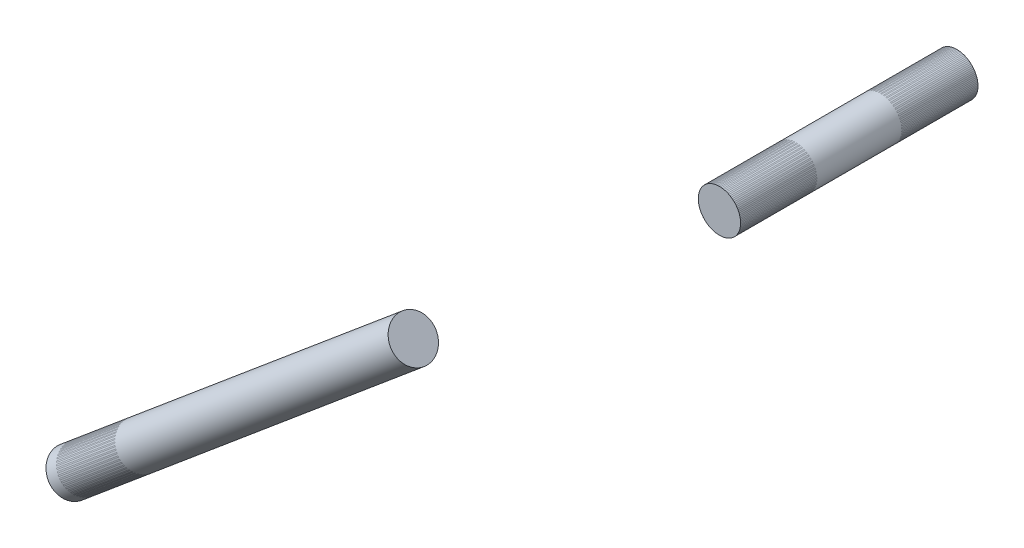
ISO-10303-21;
HEADER;
FILE_DESCRIPTION(('STEP AP214'),'2;1');
FILE_NAME('part.step','',(''),(''),'','','');
FILE_SCHEMA(('AUTOMOTIVE_DESIGN { 1 0 10303 214 1 1 1 1 }'));
ENDSEC;
DATA;
#1=APPLICATION_CONTEXT('core data for automotive mechanical design processes');
#2=APPLICATION_PROTOCOL_DEFINITION('international standard','automotive_design',2000,#1);
#3=PRODUCT_CONTEXT('',#1,'mechanical');
#4=PRODUCT('Part','Part','',(#3));
#5=PRODUCT_RELATED_PRODUCT_CATEGORY('part','',(#4));
#6=PRODUCT_DEFINITION_FORMATION('','',#4);
#7=PRODUCT_DEFINITION_CONTEXT('part definition',#1,'design');
#8=PRODUCT_DEFINITION('design','',#6,#7);
#9=PRODUCT_DEFINITION_SHAPE('','',#8);
#10=(LENGTH_UNIT() NAMED_UNIT(*) SI_UNIT(.MILLI.,.METRE.));
#11=(NAMED_UNIT(*) PLANE_ANGLE_UNIT() SI_UNIT($,.RADIAN.));
#12=(NAMED_UNIT(*) SI_UNIT($,.STERADIAN.) SOLID_ANGLE_UNIT());
#13=UNCERTAINTY_MEASURE_WITH_UNIT(LENGTH_MEASURE(1.E-05),#10,'distance_accuracy_value','');
#14=(GEOMETRIC_REPRESENTATION_CONTEXT(3) GLOBAL_UNCERTAINTY_ASSIGNED_CONTEXT((#13)) GLOBAL_UNIT_ASSIGNED_CONTEXT((#10,
#11,#12)) REPRESENTATION_CONTEXT('',''));
#15=CARTESIAN_POINT('',(0.,0.,0.));
#16=DIRECTION('',(0.,0.,1.));
#17=DIRECTION('',(1.,0.,0.));
#18=AXIS2_PLACEMENT_3D('',#15,#16,#17);
#19=CARTESIAN_POINT('',(0.,0.,48.2981000000004));
#20=DIRECTION('',(0.,0.,-1.));
#21=DIRECTION('',(-1.,0.,0.));
#22=AXIS2_PLACEMENT_3D('',#19,#20,#21);
#23=PLANE('',#22);
#24=CARTESIAN_POINT('',(0.,0.,48.2981000000004));
#25=DIRECTION('',(0.,0.,-1.));
#26=DIRECTION('',(-1.,0.,0.));
#27=AXIS2_PLACEMENT_3D('',#24,#25,#26);
#28=CIRCLE('',#27,6.35);
#29=CARTESIAN_POINT('',(-6.35000000000006,0.,48.2981000000004));
#30=VERTEX_POINT('',#29);
#31=EDGE_CURVE('E49',#30,#30,#28,.T.);
#32=ORIENTED_EDGE('',*,*,#31,.F.);
#33=EDGE_LOOP('',(#32));
#34=FACE_BOUND('',#33,.T.);
#35=ADVANCED_FACE('F42',(#34),#23,.F.);
#36=CARTESIAN_POINT('',(0.,0.,-40.8205122421383));
#37=DIRECTION('',(0.,0.,1.));
#38=DIRECTION('',(1.,0.,0.));
#39=AXIS2_PLACEMENT_3D('',#36,#37,#38);
#40=CYLINDRICAL_SURFACE('',#39,6.35);
#41=CARTESIAN_POINT('',(0.,0.,-22.86));
#42=DIRECTION('',(0.,0.,1.));
#43=DIRECTION('',(1.,0.,0.));
#44=AXIS2_PLACEMENT_3D('',#41,#42,#43);
#45=CIRCLE('',#44,6.35);
#46=CARTESIAN_POINT('',(6.34999999999994,0.,-22.86));
#47=VERTEX_POINT('',#46);
#48=EDGE_CURVE('E11',#47,#47,#45,.T.);
#49=ORIENTED_EDGE('',*,*,#48,.T.);
#50=EDGE_LOOP('',(#49));
#51=FACE_BOUND('',#50,.T.);
#52=ORIENTED_EDGE('',*,*,#31,.T.);
#53=EDGE_LOOP('',(#52));
#54=FACE_BOUND('',#53,.T.);
#55=ADVANCED_FACE('F44',(#51,#54),#40,.T.);
#56=CARTESIAN_POINT('',(0.,0.,-22.86));
#57=DIRECTION('',(0.,0.,1.));
#58=DIRECTION('',(1.,0.,0.));
#59=AXIS2_PLACEMENT_3D('',#56,#57,#58);
#60=PLANE('',#59);
#61=ORIENTED_EDGE('',*,*,#48,.F.);
#62=EDGE_LOOP('',(#61));
#63=FACE_BOUND('',#62,.T.);
#64=ADVANCED_FACE('F60',(#63),#60,.F.);
#65=CLOSED_SHELL('',(#35,#55,#64));
#66=MANIFOLD_SOLID_BREP('B2',#65);
#67=CARTESIAN_POINT('',(-181.126806004137,-151.832093299604,61.5061000000005));
#68=DIRECTION('',(0.76635965763956,0.64241176448021,0.));
#69=DIRECTION('',(-0.64241176448021,0.76635965763956,0.));
#70=AXIS2_PLACEMENT_3D('',#67,#68,#69);
#71=PLANE('',#70);
#72=CARTESIAN_POINT('',(-181.126806004137,-151.832093299604,61.5061000000005));
#73=DIRECTION('',(0.76635965763956,0.64241176448021,0.));
#74=DIRECTION('',(-0.64241176448021,0.76635965763956,0.));
#75=AXIS2_PLACEMENT_3D('',#72,#73,#74);
#76=CIRCLE('',#75,6.35000000000001);
#77=CARTESIAN_POINT('',(-185.206120708586,-146.965709473593,61.5061000000005));
#78=VERTEX_POINT('',#77);
#79=EDGE_CURVE('E98',#78,#78,#76,.T.);
#80=ORIENTED_EDGE('',*,*,#79,.F.);
#81=EDGE_LOOP('',(#80));
#82=FACE_BOUND('',#81,.T.);
#83=ADVANCED_FACE('F91',(#82),#71,.F.);
#84=CARTESIAN_POINT('',(-64.7983032426142,-54.3180893023858,61.5061000000005));
#85=DIRECTION('',(-0.76635965763956,-0.64241176448021,0.));
#86=DIRECTION('',(0.64241176448021,-0.76635965763956,0.));
#87=AXIS2_PLACEMENT_3D('',#84,#85,#86);
#88=CYLINDRICAL_SURFACE('',#87,6.35000000000001);
#89=CARTESIAN_POINT('',(-78.5625152555305,-65.8561336628263,61.5061000000005));
#90=DIRECTION('',(-0.76635965763956,-0.64241176448021,0.));
#91=DIRECTION('',(0.64241176448021,-0.76635965763956,0.));
#92=AXIS2_PLACEMENT_3D('',#89,#90,#91);
#93=CIRCLE('',#92,6.35000000000001);
#94=CARTESIAN_POINT('',(-74.4832005510812,-70.7225174888375,61.5061000000005));
#95=VERTEX_POINT('',#94);
#96=EDGE_CURVE('E41',#95,#95,#93,.T.);
#97=ORIENTED_EDGE('',*,*,#96,.T.);
#98=EDGE_LOOP('',(#97));
#99=FACE_BOUND('',#98,.T.);
#100=ORIENTED_EDGE('',*,*,#79,.T.);
#101=EDGE_LOOP('',(#100));
#102=FACE_BOUND('',#101,.T.);
#103=ADVANCED_FACE('F93',(#99,#102),#88,.T.);
#104=CARTESIAN_POINT('',(-78.5625152555304,-65.8561336628264,0.));
#105=DIRECTION('',(-0.76635965763956,-0.64241176448021,0.));
#106=DIRECTION('',(0.64241176448021,-0.76635965763956,0.));
#107=AXIS2_PLACEMENT_3D('',#104,#105,#106);
#108=PLANE('',#107);
#109=ORIENTED_EDGE('',*,*,#96,.F.);
#110=EDGE_LOOP('',(#109));
#111=FACE_BOUND('',#110,.T.);
#112=ADVANCED_FACE('F109',(#111),#108,.F.);
#113=CLOSED_SHELL('',(#83,#103,#112));
#114=MANIFOLD_SOLID_BREP('B6',#113);
#115=CARTESIAN_POINT('',(-169.254594798989,-141.880045233723,61.5061000000005));
#116=DIRECTION('',(-0.76635965763956,-0.64241176448021,0.));
#117=DIRECTION('',(0.64241176448021,-0.76635965763956,0.));
#118=AXIS2_PLACEMENT_3D('',#115,#116,#117);
#119=CYLINDRICAL_SURFACE('',#118,6.35);
#120=CARTESIAN_POINT('',(-160.495103912168,-134.537278765714,61.5061000000005));
#121=DIRECTION('',(-0.76635965763956,-0.64241176448021,0.));
#122=DIRECTION('',(0.64241176448021,-0.76635965763956,0.));
#123=AXIS2_PLACEMENT_3D('',#120,#121,#122);
#124=CIRCLE('',#123,6.35);
#125=CARTESIAN_POINT('',(-156.415789207719,-139.403662591725,61.5061000000005));
#126=VERTEX_POINT('',#125);
#127=EDGE_CURVE('E144',#126,#126,#124,.T.);
#128=ORIENTED_EDGE('',*,*,#127,.F.);
#129=EDGE_LOOP('',(#128));
#130=FACE_BOUND('',#129,.T.);
#131=CARTESIAN_POINT('',(-178.014085685809,-149.222811701732,61.5061000000005));
#132=DIRECTION('',(-0.76635965763956,-0.64241176448021,0.));
#133=DIRECTION('',(0.64241176448021,-0.76635965763956,0.));
#134=AXIS2_PLACEMENT_3D('',#131,#132,#133);
#135=CIRCLE('',#134,6.35);
#136=CARTESIAN_POINT('',(-173.934770981359,-154.089195527743,61.5061000000005));
#137=VERTEX_POINT('',#136);
#138=EDGE_CURVE('E90',#137,#137,#135,.F.);
#139=ORIENTED_EDGE('',*,*,#138,.F.);
#140=EDGE_LOOP('',(#139));
#141=FACE_BOUND('',#140,.T.);
#142=ADVANCED_FACE('F140',(#130,#141),#119,.F.);
#143=OPEN_SHELL('',(#142));
#144=SHELL_BASED_SURFACE_MODEL('B36',(#143));
#145=CARTESIAN_POINT('',(-2.33036349694127E-13,-2.32887515847656E-13,36.8681000000005));
#146=DIRECTION('',(0.,0.,1.));
#147=DIRECTION('',(-0.76635965763956,-0.64241176448021,0.));
#148=AXIS2_PLACEMENT_3D('',#145,#146,#147);
#149=CYLINDRICAL_SURFACE('',#148,6.35);
#150=CARTESIAN_POINT('',(-2.44028094463223E-13,-2.43730426770281E-13,48.2981000000005));
#151=DIRECTION('',(0.,0.,1.));
#152=DIRECTION('',(-0.76635965763956,-0.64241176448021,0.));
#153=AXIS2_PLACEMENT_3D('',#150,#151,#152);
#154=CIRCLE('',#153,6.35);
#155=CARTESIAN_POINT('',(-4.86638382601145,-4.07931470444958,48.2981000000005));
#156=VERTEX_POINT('',#155);
#157=EDGE_CURVE('E176',#156,#156,#154,.T.);
#158=ORIENTED_EDGE('',*,*,#157,.T.);
#159=EDGE_LOOP('',(#158));
#160=FACE_BOUND('',#159,.T.);
#161=CARTESIAN_POINT('',(-2.22044604925031E-13,-2.22044604925031E-13,25.4381000000005));
#162=DIRECTION('',(0.,0.,1.));
#163=DIRECTION('',(-0.76635965763956,-0.64241176448021,0.));
#164=AXIS2_PLACEMENT_3D('',#161,#162,#163);
#165=CIRCLE('',#164,6.35);
#166=CARTESIAN_POINT('',(-4.86638382601143,-4.07931470444955,25.4381000000005));
#167=VERTEX_POINT('',#166);
#168=EDGE_CURVE('E139',#167,#167,#165,.T.);
#169=ORIENTED_EDGE('',*,*,#168,.F.);
#170=EDGE_LOOP('',(#169));
#171=FACE_BOUND('',#170,.T.);
#172=ADVANCED_FACE('F172',(#160,#171),#149,.F.);
#173=OPEN_SHELL('',(#172));
#174=SHELL_BASED_SURFACE_MODEL('B85',(#173));
#175=CARTESIAN_POINT('',(-1.16831433416564E-13,0.,-11.43));
#176=DIRECTION('',(0.,0.,-1.));
#177=DIRECTION('',(-1.,0.,0.));
#178=AXIS2_PLACEMENT_3D('',#175,#176,#177);
#179=CYLINDRICAL_SURFACE('',#178,6.35);
#180=CARTESIAN_POINT('',(-1.11755493747978E-13,0.,-22.86));
#181=DIRECTION('',(0.,0.,-1.));
#182=DIRECTION('',(-1.,0.,0.));
#183=AXIS2_PLACEMENT_3D('',#180,#181,#182);
#184=CIRCLE('',#183,6.35);
#185=CARTESIAN_POINT('',(-6.35000000000011,0.,-22.86));
#186=VERTEX_POINT('',#185);
#187=EDGE_CURVE('E201',#186,#186,#184,.F.);
#188=ORIENTED_EDGE('',*,*,#187,.F.);
#189=EDGE_LOOP('',(#188));
#190=FACE_BOUND('',#189,.T.);
#191=CARTESIAN_POINT('',(-1.21907373085151E-13,0.,0.));
#192=DIRECTION('',(0.,0.,-1.));
#193=DIRECTION('',(-1.,0.,0.));
#194=AXIS2_PLACEMENT_3D('',#191,#192,#193);
#195=CIRCLE('',#194,6.35);
#196=CARTESIAN_POINT('',(-6.35000000000012,0.,0.));
#197=VERTEX_POINT('',#196);
#198=EDGE_CURVE('E171',#197,#197,#195,.T.);
#199=ORIENTED_EDGE('',*,*,#198,.F.);
#200=EDGE_LOOP('',(#199));
#201=FACE_BOUND('',#200,.T.);
#202=ADVANCED_FACE('F197',(#190,#201),#179,.F.);
#203=OPEN_SHELL('',(#202));
#204=SHELL_BASED_SURFACE_MODEL('B134',(#203));
#205=ADVANCED_BREP_SHAPE_REPRESENTATION('',(#18,#66,#114),#14);
#206=MANIFOLD_SURFACE_SHAPE_REPRESENTATION('',(#18,#144,#174,#204),#14);
#207=SHAPE_REPRESENTATION('',(#18),#14);
#208=SHAPE_DEFINITION_REPRESENTATION(#9,#207);
#209=SHAPE_REPRESENTATION_RELATIONSHIP('','',#207,#205);
#210=SHAPE_REPRESENTATION_RELATIONSHIP('','',#207,#206);
ENDSEC;
END-ISO-10303-21;
